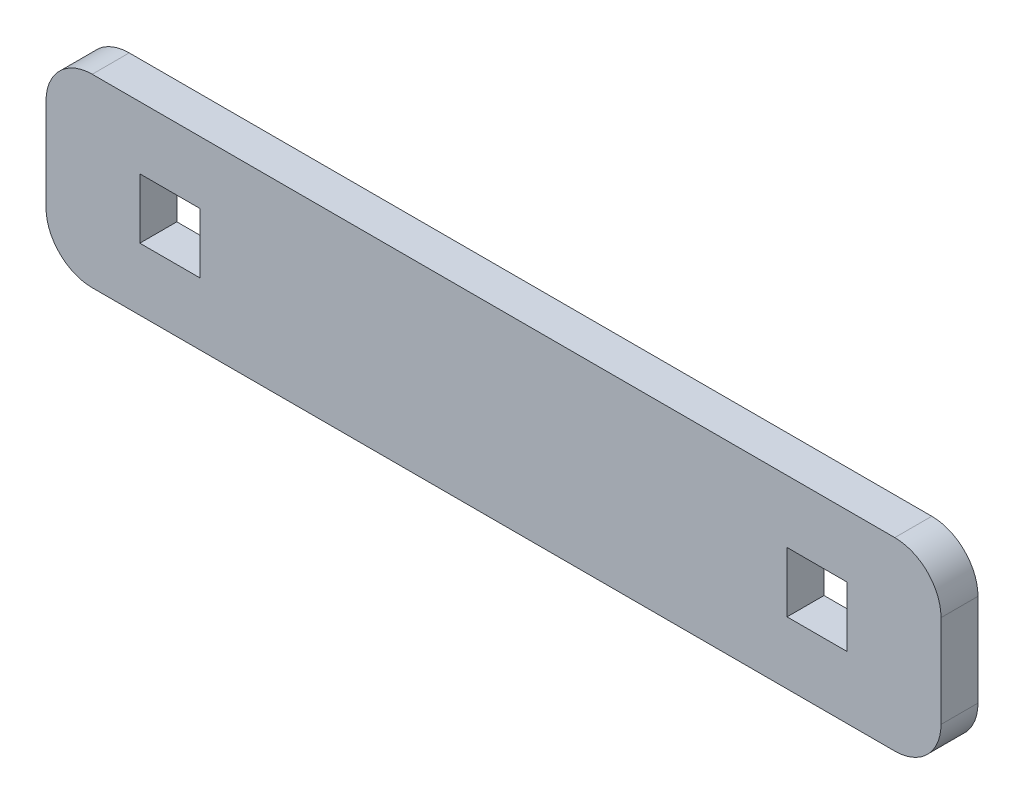
ISO-10303-21;
HEADER;
FILE_DESCRIPTION(('STEP AP214'),'2;1');
FILE_NAME('part.step','',(''),(''),'','','');
FILE_SCHEMA(('AUTOMOTIVE_DESIGN { 1 0 10303 214 1 1 1 1 }'));
ENDSEC;
DATA;
#1=APPLICATION_CONTEXT('core data for automotive mechanical design processes');
#2=APPLICATION_PROTOCOL_DEFINITION('international standard','automotive_design',2000,#1);
#3=PRODUCT_CONTEXT('',#1,'mechanical');
#4=PRODUCT('Part','Part','',(#3));
#5=PRODUCT_RELATED_PRODUCT_CATEGORY('part','',(#4));
#6=PRODUCT_DEFINITION_FORMATION('','',#4);
#7=PRODUCT_DEFINITION_CONTEXT('part definition',#1,'design');
#8=PRODUCT_DEFINITION('design','',#6,#7);
#9=PRODUCT_DEFINITION_SHAPE('','',#8);
#10=(LENGTH_UNIT() NAMED_UNIT(*) SI_UNIT(.MILLI.,.METRE.));
#11=(NAMED_UNIT(*) PLANE_ANGLE_UNIT() SI_UNIT($,.RADIAN.));
#12=(NAMED_UNIT(*) SI_UNIT($,.STERADIAN.) SOLID_ANGLE_UNIT());
#13=UNCERTAINTY_MEASURE_WITH_UNIT(LENGTH_MEASURE(1.E-05),#10,'distance_accuracy_value','');
#14=(GEOMETRIC_REPRESENTATION_CONTEXT(3) GLOBAL_UNCERTAINTY_ASSIGNED_CONTEXT((#13)) GLOBAL_UNIT_ASSIGNED_CONTEXT((#10,
#11,#12)) REPRESENTATION_CONTEXT('',''));
#15=CARTESIAN_POINT('',(0.,0.,0.));
#16=DIRECTION('',(0.,0.,1.));
#17=DIRECTION('',(1.,0.,0.));
#18=AXIS2_PLACEMENT_3D('',#15,#16,#17);
#19=CARTESIAN_POINT('',(-48.4,-10.,-4.));
#20=DIRECTION('',(-1.,0.,0.));
#21=DIRECTION('',(0.,-1.,0.));
#22=AXIS2_PLACEMENT_3D('',#19,#20,#21);
#23=PLANE('',#22);
#24=DIRECTION('',(0.,-1.,0.));
#25=VECTOR('',#24,1.);
#26=CARTESIAN_POINT('',(-48.4,-10.,-4.));
#27=LINE('',#26,#25);
#28=CARTESIAN_POINT('',(-48.4,5.,-4.));
#29=VERTEX_POINT('',#28);
#30=CARTESIAN_POINT('',(-48.4,-5.,-4.));
#31=VERTEX_POINT('',#30);
#32=EDGE_CURVE('E255',#29,#31,#27,.T.);
#33=ORIENTED_EDGE('',*,*,#32,.T.);
#34=DIRECTION('',(0.,0.,1.));
#35=VECTOR('',#34,1.);
#36=CARTESIAN_POINT('',(-48.4,-5.,-4.));
#37=LINE('',#36,#35);
#38=CARTESIAN_POINT('',(-48.4,-5.,0.));
#39=VERTEX_POINT('',#38);
#40=EDGE_CURVE('E288',#31,#39,#37,.T.);
#41=ORIENTED_EDGE('',*,*,#40,.T.);
#42=DIRECTION('',(0.,-1.,0.));
#43=VECTOR('',#42,1.);
#44=CARTESIAN_POINT('',(-48.4,-10.,0.));
#45=LINE('',#44,#43);
#46=CARTESIAN_POINT('',(-48.4,5.,0.));
#47=VERTEX_POINT('',#46);
#48=EDGE_CURVE('E245',#47,#39,#45,.T.);
#49=ORIENTED_EDGE('',*,*,#48,.F.);
#50=DIRECTION('',(0.,0.,1.));
#51=VECTOR('',#50,1.);
#52=CARTESIAN_POINT('',(-48.4,5.,-4.));
#53=LINE('',#52,#51);
#54=EDGE_CURVE('E271',#47,#29,#53,.F.);
#55=ORIENTED_EDGE('',*,*,#54,.T.);
#56=EDGE_LOOP('',(#33,#41,#49,#55));
#57=FACE_BOUND('',#56,.T.);
#58=ADVANCED_FACE('F40',(#57),#23,.T.);
#59=CARTESIAN_POINT('',(48.4,10.,-4.));
#60=DIRECTION('',(0.,1.,0.));
#61=DIRECTION('',(0.,0.,1.));
#62=AXIS2_PLACEMENT_3D('',#59,#60,#61);
#63=PLANE('',#62);
#64=DIRECTION('',(-1.,0.,0.));
#65=VECTOR('',#64,1.);
#66=CARTESIAN_POINT('',(48.4,10.,-4.));
#67=LINE('',#66,#65);
#68=CARTESIAN_POINT('',(43.4,10.,-4.));
#69=VERTEX_POINT('',#68);
#70=CARTESIAN_POINT('',(-43.4,10.,-4.));
#71=VERTEX_POINT('',#70);
#72=EDGE_CURVE('E267',#69,#71,#67,.T.);
#73=ORIENTED_EDGE('',*,*,#72,.T.);
#74=DIRECTION('',(0.,0.,1.));
#75=VECTOR('',#74,1.);
#76=CARTESIAN_POINT('',(-43.4,10.,-4.));
#77=LINE('',#76,#75);
#78=CARTESIAN_POINT('',(-43.4,10.,0.));
#79=VERTEX_POINT('',#78);
#80=EDGE_CURVE('E325',#71,#79,#77,.T.);
#81=ORIENTED_EDGE('',*,*,#80,.T.);
#82=DIRECTION('',(-1.,0.,0.));
#83=VECTOR('',#82,1.);
#84=CARTESIAN_POINT('',(48.4,10.,0.));
#85=LINE('',#84,#83);
#86=CARTESIAN_POINT('',(43.4,10.,0.));
#87=VERTEX_POINT('',#86);
#88=EDGE_CURVE('E260',#87,#79,#85,.T.);
#89=ORIENTED_EDGE('',*,*,#88,.F.);
#90=DIRECTION('',(0.,0.,1.));
#91=VECTOR('',#90,1.);
#92=CARTESIAN_POINT('',(43.4,10.,-4.));
#93=LINE('',#92,#91);
#94=EDGE_CURVE('E322',#87,#69,#93,.F.);
#95=ORIENTED_EDGE('',*,*,#94,.T.);
#96=EDGE_LOOP('',(#73,#81,#89,#95));
#97=FACE_BOUND('',#96,.T.);
#98=ADVANCED_FACE('F359',(#97),#63,.T.);
#99=CARTESIAN_POINT('',(48.4,-10.,-4.));
#100=DIRECTION('',(1.,0.,0.));
#101=DIRECTION('',(0.,1.,0.));
#102=AXIS2_PLACEMENT_3D('',#99,#100,#101);
#103=PLANE('',#102);
#104=DIRECTION('',(0.,1.,0.));
#105=VECTOR('',#104,1.);
#106=CARTESIAN_POINT('',(48.4,-10.,0.));
#107=LINE('',#106,#105);
#108=CARTESIAN_POINT('',(48.4,-5.,0.));
#109=VERTEX_POINT('',#108);
#110=CARTESIAN_POINT('',(48.4,5.,0.));
#111=VERTEX_POINT('',#110);
#112=EDGE_CURVE('E279',#109,#111,#107,.T.);
#113=ORIENTED_EDGE('',*,*,#112,.F.);
#114=DIRECTION('',(0.,0.,1.));
#115=VECTOR('',#114,1.);
#116=CARTESIAN_POINT('',(48.4,-5.,-4.));
#117=LINE('',#116,#115);
#118=CARTESIAN_POINT('',(48.4,-5.,-4.));
#119=VERTEX_POINT('',#118);
#120=EDGE_CURVE('E11',#109,#119,#117,.F.);
#121=ORIENTED_EDGE('',*,*,#120,.T.);
#122=DIRECTION('',(0.,1.,0.));
#123=VECTOR('',#122,1.);
#124=CARTESIAN_POINT('',(48.4,-10.,-4.));
#125=LINE('',#124,#123);
#126=CARTESIAN_POINT('',(48.4,5.,-4.));
#127=VERTEX_POINT('',#126);
#128=EDGE_CURVE('E264',#119,#127,#125,.T.);
#129=ORIENTED_EDGE('',*,*,#128,.T.);
#130=DIRECTION('',(0.,0.,1.));
#131=VECTOR('',#130,1.);
#132=CARTESIAN_POINT('',(48.4,5.,-4.));
#133=LINE('',#132,#131);
#134=EDGE_CURVE('E49',#127,#111,#133,.T.);
#135=ORIENTED_EDGE('',*,*,#134,.T.);
#136=EDGE_LOOP('',(#113,#121,#129,#135));
#137=FACE_BOUND('',#136,.T.);
#138=ADVANCED_FACE('F332',(#137),#103,.T.);
#139=CARTESIAN_POINT('',(48.4,-10.,-4.));
#140=DIRECTION('',(0.,-1.,0.));
#141=DIRECTION('',(0.,0.,-1.));
#142=AXIS2_PLACEMENT_3D('',#139,#140,#141);
#143=PLANE('',#142);
#144=DIRECTION('',(1.,0.,0.));
#145=VECTOR('',#144,1.);
#146=CARTESIAN_POINT('',(48.4,-10.,0.));
#147=LINE('',#146,#145);
#148=CARTESIAN_POINT('',(-43.4,-10.,0.));
#149=VERTEX_POINT('',#148);
#150=CARTESIAN_POINT('',(43.4,-10.,0.));
#151=VERTEX_POINT('',#150);
#152=EDGE_CURVE('E275',#149,#151,#147,.T.);
#153=ORIENTED_EDGE('',*,*,#152,.F.);
#154=DIRECTION('',(0.,0.,1.));
#155=VECTOR('',#154,1.);
#156=CARTESIAN_POINT('',(-43.4,-10.,-4.));
#157=LINE('',#156,#155);
#158=CARTESIAN_POINT('',(-43.4,-10.,-4.));
#159=VERTEX_POINT('',#158);
#160=EDGE_CURVE('E308',#149,#159,#157,.F.);
#161=ORIENTED_EDGE('',*,*,#160,.T.);
#162=DIRECTION('',(1.,0.,0.));
#163=VECTOR('',#162,1.);
#164=CARTESIAN_POINT('',(48.4,-10.,-4.));
#165=LINE('',#164,#163);
#166=CARTESIAN_POINT('',(43.4,-10.,-4.));
#167=VERTEX_POINT('',#166);
#168=EDGE_CURVE('E259',#159,#167,#165,.T.);
#169=ORIENTED_EDGE('',*,*,#168,.T.);
#170=DIRECTION('',(0.,0.,1.));
#171=VECTOR('',#170,1.);
#172=CARTESIAN_POINT('',(43.4,-10.,-4.));
#173=LINE('',#172,#171);
#174=EDGE_CURVE('E304',#167,#151,#173,.T.);
#175=ORIENTED_EDGE('',*,*,#174,.T.);
#176=EDGE_LOOP('',(#153,#161,#169,#175));
#177=FACE_BOUND('',#176,.T.);
#178=ADVANCED_FACE('F343',(#177),#143,.T.);
#179=CARTESIAN_POINT('',(0.,0.,-4.));
#180=DIRECTION('',(0.,0.,1.));
#181=DIRECTION('',(1.,0.,0.));
#182=AXIS2_PLACEMENT_3D('',#179,#180,#181);
#183=PLANE('',#182);
#184=DIRECTION('',(1.,0.,0.));
#185=VECTOR('',#184,1.);
#186=CARTESIAN_POINT('',(38.25,-3.25,-4.));
#187=LINE('',#186,#185);
#188=CARTESIAN_POINT('',(31.75,-3.25,-4.));
#189=VERTEX_POINT('',#188);
#190=CARTESIAN_POINT('',(38.25,-3.25,-4.));
#191=VERTEX_POINT('',#190);
#192=EDGE_CURVE('E167',#189,#191,#187,.T.);
#193=ORIENTED_EDGE('',*,*,#192,.T.);
#194=DIRECTION('',(0.,1.,0.));
#195=VECTOR('',#194,1.);
#196=CARTESIAN_POINT('',(38.25,-3.25,-4.));
#197=LINE('',#196,#195);
#198=CARTESIAN_POINT('',(38.25,3.25,-4.));
#199=VERTEX_POINT('',#198);
#200=EDGE_CURVE('E158',#191,#199,#197,.T.);
#201=ORIENTED_EDGE('',*,*,#200,.T.);
#202=DIRECTION('',(-1.,0.,0.));
#203=VECTOR('',#202,1.);
#204=CARTESIAN_POINT('',(38.25,3.25,-4.));
#205=LINE('',#204,#203);
#206=CARTESIAN_POINT('',(31.75,3.25,-4.));
#207=VERTEX_POINT('',#206);
#208=EDGE_CURVE('E171',#199,#207,#205,.T.);
#209=ORIENTED_EDGE('',*,*,#208,.T.);
#210=DIRECTION('',(0.,-1.,0.));
#211=VECTOR('',#210,1.);
#212=CARTESIAN_POINT('',(31.75,-3.25,-4.));
#213=LINE('',#212,#211);
#214=EDGE_CURVE('E176',#207,#189,#213,.T.);
#215=ORIENTED_EDGE('',*,*,#214,.T.);
#216=EDGE_LOOP('',(#193,#201,#209,#215));
#217=FACE_BOUND('',#216,.T.);
#218=DIRECTION('',(1.,0.,0.));
#219=VECTOR('',#218,1.);
#220=CARTESIAN_POINT('',(-38.25,-3.25,-4.));
#221=LINE('',#220,#219);
#222=CARTESIAN_POINT('',(-38.25,-3.25,-4.));
#223=VERTEX_POINT('',#222);
#224=CARTESIAN_POINT('',(-31.75,-3.25,-4.));
#225=VERTEX_POINT('',#224);
#226=EDGE_CURVE('E224',#223,#225,#221,.T.);
#227=ORIENTED_EDGE('',*,*,#226,.T.);
#228=DIRECTION('',(0.,1.,0.));
#229=VECTOR('',#228,1.);
#230=CARTESIAN_POINT('',(-31.75,-3.25,-4.));
#231=LINE('',#230,#229);
#232=CARTESIAN_POINT('',(-31.75,3.25,-4.));
#233=VERTEX_POINT('',#232);
#234=EDGE_CURVE('E211',#225,#233,#231,.T.);
#235=ORIENTED_EDGE('',*,*,#234,.T.);
#236=DIRECTION('',(-1.,0.,0.));
#237=VECTOR('',#236,1.);
#238=CARTESIAN_POINT('',(-38.25,3.25,-4.));
#239=LINE('',#238,#237);
#240=CARTESIAN_POINT('',(-38.25,3.25,-4.));
#241=VERTEX_POINT('',#240);
#242=EDGE_CURVE('E215',#233,#241,#239,.T.);
#243=ORIENTED_EDGE('',*,*,#242,.T.);
#244=DIRECTION('',(0.,-1.,0.));
#245=VECTOR('',#244,1.);
#246=CARTESIAN_POINT('',(-38.25,-3.25,-4.));
#247=LINE('',#246,#245);
#248=EDGE_CURVE('E220',#241,#223,#247,.T.);
#249=ORIENTED_EDGE('',*,*,#248,.T.);
#250=EDGE_LOOP('',(#227,#235,#243,#249));
#251=FACE_BOUND('',#250,.T.);
#252=ORIENTED_EDGE('',*,*,#168,.F.);
#253=CARTESIAN_POINT('',(-43.4,-5.,-4.));
#254=DIRECTION('',(0.,0.,1.));
#255=DIRECTION('',(1.,0.,0.));
#256=AXIS2_PLACEMENT_3D('',#253,#254,#255);
#257=CIRCLE('',#256,5.);
#258=EDGE_CURVE('E319',#159,#31,#257,.F.);
#259=ORIENTED_EDGE('',*,*,#258,.T.);
#260=ORIENTED_EDGE('',*,*,#32,.F.);
#261=CARTESIAN_POINT('',(-43.4,5.,-4.));
#262=DIRECTION('',(0.,0.,1.));
#263=DIRECTION('',(1.,0.,0.));
#264=AXIS2_PLACEMENT_3D('',#261,#262,#263);
#265=CIRCLE('',#264,5.);
#266=EDGE_CURVE('E316',#29,#71,#265,.F.);
#267=ORIENTED_EDGE('',*,*,#266,.T.);
#268=ORIENTED_EDGE('',*,*,#72,.F.);
#269=CARTESIAN_POINT('',(43.4,5.,-4.));
#270=DIRECTION('',(0.,0.,1.));
#271=DIRECTION('',(1.,0.,0.));
#272=AXIS2_PLACEMENT_3D('',#269,#270,#271);
#273=CIRCLE('',#272,5.);
#274=EDGE_CURVE('E56',#69,#127,#273,.F.);
#275=ORIENTED_EDGE('',*,*,#274,.T.);
#276=ORIENTED_EDGE('',*,*,#128,.F.);
#277=CARTESIAN_POINT('',(43.4,-5.,-4.));
#278=DIRECTION('',(0.,0.,1.));
#279=DIRECTION('',(1.,0.,0.));
#280=AXIS2_PLACEMENT_3D('',#277,#278,#279);
#281=CIRCLE('',#280,5.);
#282=EDGE_CURVE('E313',#119,#167,#281,.F.);
#283=ORIENTED_EDGE('',*,*,#282,.T.);
#284=EDGE_LOOP('',(#252,#259,#260,#267,#268,#275,#276,#283));
#285=FACE_BOUND('',#284,.T.);
#286=ADVANCED_FACE('F178',(#217,#251,#285),#183,.F.);
#287=CARTESIAN_POINT('',(0.,0.,0.));
#288=DIRECTION('',(0.,0.,1.));
#289=DIRECTION('',(1.,0.,0.));
#290=AXIS2_PLACEMENT_3D('',#287,#288,#289);
#291=PLANE('',#290);
#292=DIRECTION('',(0.,1.,0.));
#293=VECTOR('',#292,1.);
#294=CARTESIAN_POINT('',(38.25,-3.25,0.));
#295=LINE('',#294,#293);
#296=CARTESIAN_POINT('',(38.25,-3.25,0.));
#297=VERTEX_POINT('',#296);
#298=CARTESIAN_POINT('',(38.25,3.25,0.));
#299=VERTEX_POINT('',#298);
#300=EDGE_CURVE('E161',#297,#299,#295,.T.);
#301=ORIENTED_EDGE('',*,*,#300,.F.);
#302=DIRECTION('',(1.,0.,0.));
#303=VECTOR('',#302,1.);
#304=CARTESIAN_POINT('',(38.25,-3.25,0.));
#305=LINE('',#304,#303);
#306=CARTESIAN_POINT('',(31.75,-3.25,0.));
#307=VERTEX_POINT('',#306);
#308=EDGE_CURVE('E182',#307,#297,#305,.T.);
#309=ORIENTED_EDGE('',*,*,#308,.F.);
#310=DIRECTION('',(0.,-1.,0.));
#311=VECTOR('',#310,1.);
#312=CARTESIAN_POINT('',(31.75,-3.25,0.));
#313=LINE('',#312,#311);
#314=CARTESIAN_POINT('',(31.75,3.25,0.));
#315=VERTEX_POINT('',#314);
#316=EDGE_CURVE('E187',#315,#307,#313,.T.);
#317=ORIENTED_EDGE('',*,*,#316,.F.);
#318=DIRECTION('',(-1.,0.,0.));
#319=VECTOR('',#318,1.);
#320=CARTESIAN_POINT('',(38.25,3.25,0.));
#321=LINE('',#320,#319);
#322=EDGE_CURVE('E196',#299,#315,#321,.T.);
#323=ORIENTED_EDGE('',*,*,#322,.F.);
#324=EDGE_LOOP('',(#301,#309,#317,#323));
#325=FACE_BOUND('',#324,.T.);
#326=DIRECTION('',(0.,1.,0.));
#327=VECTOR('',#326,1.);
#328=CARTESIAN_POINT('',(-31.75,-3.25,0.));
#329=LINE('',#328,#327);
#330=CARTESIAN_POINT('',(-31.75,-3.25,0.));
#331=VERTEX_POINT('',#330);
#332=CARTESIAN_POINT('',(-31.75,3.25,0.));
#333=VERTEX_POINT('',#332);
#334=EDGE_CURVE('E205',#331,#333,#329,.T.);
#335=ORIENTED_EDGE('',*,*,#334,.F.);
#336=DIRECTION('',(1.,0.,0.));
#337=VECTOR('',#336,1.);
#338=CARTESIAN_POINT('',(-38.25,-3.25,0.));
#339=LINE('',#338,#337);
#340=CARTESIAN_POINT('',(-38.25,-3.25,0.));
#341=VERTEX_POINT('',#340);
#342=EDGE_CURVE('E216',#341,#331,#339,.T.);
#343=ORIENTED_EDGE('',*,*,#342,.F.);
#344=DIRECTION('',(0.,-1.,0.));
#345=VECTOR('',#344,1.);
#346=CARTESIAN_POINT('',(-38.25,-3.25,0.));
#347=LINE('',#346,#345);
#348=CARTESIAN_POINT('',(-38.25,3.25,0.));
#349=VERTEX_POINT('',#348);
#350=EDGE_CURVE('E235',#349,#341,#347,.T.);
#351=ORIENTED_EDGE('',*,*,#350,.F.);
#352=DIRECTION('',(-1.,0.,0.));
#353=VECTOR('',#352,1.);
#354=CARTESIAN_POINT('',(-38.25,3.25,0.));
#355=LINE('',#354,#353);
#356=EDGE_CURVE('E231',#333,#349,#355,.T.);
#357=ORIENTED_EDGE('',*,*,#356,.F.);
#358=EDGE_LOOP('',(#335,#343,#351,#357));
#359=FACE_BOUND('',#358,.T.);
#360=ORIENTED_EDGE('',*,*,#48,.T.);
#361=CARTESIAN_POINT('',(-43.4,-5.,0.));
#362=DIRECTION('',(0.,0.,1.));
#363=DIRECTION('',(1.,0.,0.));
#364=AXIS2_PLACEMENT_3D('',#361,#362,#363);
#365=CIRCLE('',#364,5.);
#366=EDGE_CURVE('E301',#39,#149,#365,.T.);
#367=ORIENTED_EDGE('',*,*,#366,.T.);
#368=ORIENTED_EDGE('',*,*,#152,.T.);
#369=CARTESIAN_POINT('',(43.4,-5.,0.));
#370=DIRECTION('',(0.,0.,1.));
#371=DIRECTION('',(1.,0.,0.));
#372=AXIS2_PLACEMENT_3D('',#369,#370,#371);
#373=CIRCLE('',#372,5.);
#374=EDGE_CURVE('E295',#151,#109,#373,.T.);
#375=ORIENTED_EDGE('',*,*,#374,.T.);
#376=ORIENTED_EDGE('',*,*,#112,.T.);
#377=CARTESIAN_POINT('',(43.4,5.,0.));
#378=DIRECTION('',(0.,0.,1.));
#379=DIRECTION('',(1.,0.,0.));
#380=AXIS2_PLACEMENT_3D('',#377,#378,#379);
#381=CIRCLE('',#380,5.);
#382=EDGE_CURVE('E292',#111,#87,#381,.T.);
#383=ORIENTED_EDGE('',*,*,#382,.T.);
#384=ORIENTED_EDGE('',*,*,#88,.T.);
#385=CARTESIAN_POINT('',(-43.4,5.,0.));
#386=DIRECTION('',(0.,0.,1.));
#387=DIRECTION('',(1.,0.,0.));
#388=AXIS2_PLACEMENT_3D('',#385,#386,#387);
#389=CIRCLE('',#388,5.);
#390=EDGE_CURVE('E298',#79,#47,#389,.T.);
#391=ORIENTED_EDGE('',*,*,#390,.T.);
#392=EDGE_LOOP('',(#360,#367,#368,#375,#376,#383,#384,#391));
#393=FACE_BOUND('',#392,.T.);
#394=ADVANCED_FACE('F335',(#325,#359,#393),#291,.T.);
#395=CARTESIAN_POINT('',(-31.75,-3.25,-4.));
#396=DIRECTION('',(1.,0.,0.));
#397=DIRECTION('',(0.,0.,-1.));
#398=AXIS2_PLACEMENT_3D('',#395,#396,#397);
#399=PLANE('',#398);
#400=ORIENTED_EDGE('',*,*,#334,.T.);
#401=DIRECTION('',(0.,0.,1.));
#402=VECTOR('',#401,1.);
#403=CARTESIAN_POINT('',(-31.75,3.25,-4.));
#404=LINE('',#403,#402);
#405=EDGE_CURVE('E228',#233,#333,#404,.T.);
#406=ORIENTED_EDGE('',*,*,#405,.F.);
#407=ORIENTED_EDGE('',*,*,#234,.F.);
#408=DIRECTION('',(0.,0.,1.));
#409=VECTOR('',#408,1.);
#410=CARTESIAN_POINT('',(-31.75,-3.25,-4.));
#411=LINE('',#410,#409);
#412=EDGE_CURVE('E242',#225,#331,#411,.T.);
#413=ORIENTED_EDGE('',*,*,#412,.T.);
#414=EDGE_LOOP('',(#400,#406,#407,#413));
#415=FACE_BOUND('',#414,.T.);
#416=ADVANCED_FACE('F487',(#415),#399,.F.);
#417=CARTESIAN_POINT('',(-38.25,-3.25,-4.));
#418=DIRECTION('',(0.,-1.,0.));
#419=DIRECTION('',(0.,0.,-1.));
#420=AXIS2_PLACEMENT_3D('',#417,#418,#419);
#421=PLANE('',#420);
#422=ORIENTED_EDGE('',*,*,#342,.T.);
#423=ORIENTED_EDGE('',*,*,#412,.F.);
#424=ORIENTED_EDGE('',*,*,#226,.F.);
#425=DIRECTION('',(0.,0.,1.));
#426=VECTOR('',#425,1.);
#427=CARTESIAN_POINT('',(-38.25,-3.25,-4.));
#428=LINE('',#427,#426);
#429=EDGE_CURVE('E246',#223,#341,#428,.T.);
#430=ORIENTED_EDGE('',*,*,#429,.T.);
#431=EDGE_LOOP('',(#422,#423,#424,#430));
#432=FACE_BOUND('',#431,.T.);
#433=ADVANCED_FACE('F476',(#432),#421,.F.);
#434=CARTESIAN_POINT('',(-38.25,-3.25,-4.));
#435=DIRECTION('',(-1.,0.,0.));
#436=DIRECTION('',(0.,0.,1.));
#437=AXIS2_PLACEMENT_3D('',#434,#435,#436);
#438=PLANE('',#437);
#439=ORIENTED_EDGE('',*,*,#350,.T.);
#440=ORIENTED_EDGE('',*,*,#429,.F.);
#441=ORIENTED_EDGE('',*,*,#248,.F.);
#442=DIRECTION('',(0.,0.,1.));
#443=VECTOR('',#442,1.);
#444=CARTESIAN_POINT('',(-38.25,3.25,-4.));
#445=LINE('',#444,#443);
#446=EDGE_CURVE('E249',#241,#349,#445,.T.);
#447=ORIENTED_EDGE('',*,*,#446,.T.);
#448=EDGE_LOOP('',(#439,#440,#441,#447));
#449=FACE_BOUND('',#448,.T.);
#450=ADVANCED_FACE('F465',(#449),#438,.F.);
#451=CARTESIAN_POINT('',(-38.25,3.25,-4.));
#452=DIRECTION('',(0.,1.,0.));
#453=DIRECTION('',(0.,0.,1.));
#454=AXIS2_PLACEMENT_3D('',#451,#452,#453);
#455=PLANE('',#454);
#456=ORIENTED_EDGE('',*,*,#356,.T.);
#457=ORIENTED_EDGE('',*,*,#446,.F.);
#458=ORIENTED_EDGE('',*,*,#242,.F.);
#459=ORIENTED_EDGE('',*,*,#405,.T.);
#460=EDGE_LOOP('',(#456,#457,#458,#459));
#461=FACE_BOUND('',#460,.T.);
#462=ADVANCED_FACE('F455',(#461),#455,.F.);
#463=CARTESIAN_POINT('',(38.25,-3.25,-4.));
#464=DIRECTION('',(1.,0.,0.));
#465=DIRECTION('',(0.,0.,-1.));
#466=AXIS2_PLACEMENT_3D('',#463,#464,#465);
#467=PLANE('',#466);
#468=ORIENTED_EDGE('',*,*,#300,.T.);
#469=DIRECTION('',(0.,0.,1.));
#470=VECTOR('',#469,1.);
#471=CARTESIAN_POINT('',(38.25,3.25,-4.));
#472=LINE('',#471,#470);
#473=EDGE_CURVE('E154',#199,#299,#472,.T.);
#474=ORIENTED_EDGE('',*,*,#473,.F.);
#475=ORIENTED_EDGE('',*,*,#200,.F.);
#476=DIRECTION('',(0.,0.,1.));
#477=VECTOR('',#476,1.);
#478=CARTESIAN_POINT('',(38.25,-3.25,-4.));
#479=LINE('',#478,#477);
#480=EDGE_CURVE('E202',#191,#297,#479,.T.);
#481=ORIENTED_EDGE('',*,*,#480,.T.);
#482=EDGE_LOOP('',(#468,#474,#475,#481));
#483=FACE_BOUND('',#482,.T.);
#484=ADVANCED_FACE('F156',(#483),#467,.F.);
#485=CARTESIAN_POINT('',(38.25,-3.25,-4.));
#486=DIRECTION('',(0.,-1.,0.));
#487=DIRECTION('',(0.,0.,-1.));
#488=AXIS2_PLACEMENT_3D('',#485,#486,#487);
#489=PLANE('',#488);
#490=ORIENTED_EDGE('',*,*,#308,.T.);
#491=ORIENTED_EDGE('',*,*,#480,.F.);
#492=ORIENTED_EDGE('',*,*,#192,.F.);
#493=DIRECTION('',(0.,0.,1.));
#494=VECTOR('',#493,1.);
#495=CARTESIAN_POINT('',(31.75,-3.25,-4.));
#496=LINE('',#495,#494);
#497=EDGE_CURVE('E206',#189,#307,#496,.T.);
#498=ORIENTED_EDGE('',*,*,#497,.T.);
#499=EDGE_LOOP('',(#490,#491,#492,#498));
#500=FACE_BOUND('',#499,.T.);
#501=ADVANCED_FACE('F434',(#500),#489,.F.);
#502=CARTESIAN_POINT('',(31.75,-3.25,-4.));
#503=DIRECTION('',(-1.,0.,0.));
#504=DIRECTION('',(0.,0.,1.));
#505=AXIS2_PLACEMENT_3D('',#502,#503,#504);
#506=PLANE('',#505);
#507=ORIENTED_EDGE('',*,*,#316,.T.);
#508=ORIENTED_EDGE('',*,*,#497,.F.);
#509=ORIENTED_EDGE('',*,*,#214,.F.);
#510=DIRECTION('',(0.,0.,1.));
#511=VECTOR('',#510,1.);
#512=CARTESIAN_POINT('',(31.75,3.25,-4.));
#513=LINE('',#512,#511);
#514=EDGE_CURVE('E166',#207,#315,#513,.T.);
#515=ORIENTED_EDGE('',*,*,#514,.T.);
#516=EDGE_LOOP('',(#507,#508,#509,#515));
#517=FACE_BOUND('',#516,.T.);
#518=ADVANCED_FACE('F424',(#517),#506,.F.);
#519=CARTESIAN_POINT('',(38.25,3.25,-4.));
#520=DIRECTION('',(0.,1.,0.));
#521=DIRECTION('',(0.,0.,1.));
#522=AXIS2_PLACEMENT_3D('',#519,#520,#521);
#523=PLANE('',#522);
#524=ORIENTED_EDGE('',*,*,#322,.T.);
#525=ORIENTED_EDGE('',*,*,#514,.F.);
#526=ORIENTED_EDGE('',*,*,#208,.F.);
#527=ORIENTED_EDGE('',*,*,#473,.T.);
#528=EDGE_LOOP('',(#524,#525,#526,#527));
#529=FACE_BOUND('',#528,.T.);
#530=ADVANCED_FACE('F172',(#529),#523,.F.);
#531=CARTESIAN_POINT('',(-43.4,-5.,-4.));
#532=DIRECTION('',(0.,0.,1.));
#533=DIRECTION('',(1.,0.,0.));
#534=AXIS2_PLACEMENT_3D('',#531,#532,#533);
#535=CYLINDRICAL_SURFACE('',#534,5.);
#536=ORIENTED_EDGE('',*,*,#258,.F.);
#537=ORIENTED_EDGE('',*,*,#160,.F.);
#538=ORIENTED_EDGE('',*,*,#366,.F.);
#539=ORIENTED_EDGE('',*,*,#40,.F.);
#540=EDGE_LOOP('',(#536,#537,#538,#539));
#541=FACE_BOUND('',#540,.T.);
#542=ADVANCED_FACE('F350',(#541),#535,.T.);
#543=CARTESIAN_POINT('',(-43.4,5.,-4.));
#544=DIRECTION('',(0.,0.,1.));
#545=DIRECTION('',(1.,0.,0.));
#546=AXIS2_PLACEMENT_3D('',#543,#544,#545);
#547=CYLINDRICAL_SURFACE('',#546,5.);
#548=ORIENTED_EDGE('',*,*,#266,.F.);
#549=ORIENTED_EDGE('',*,*,#54,.F.);
#550=ORIENTED_EDGE('',*,*,#390,.F.);
#551=ORIENTED_EDGE('',*,*,#80,.F.);
#552=EDGE_LOOP('',(#548,#549,#550,#551));
#553=FACE_BOUND('',#552,.T.);
#554=ADVANCED_FACE('F357',(#553),#547,.T.);
#555=CARTESIAN_POINT('',(43.4,-5.,-4.));
#556=DIRECTION('',(0.,0.,1.));
#557=DIRECTION('',(1.,0.,0.));
#558=AXIS2_PLACEMENT_3D('',#555,#556,#557);
#559=CYLINDRICAL_SURFACE('',#558,5.);
#560=ORIENTED_EDGE('',*,*,#282,.F.);
#561=ORIENTED_EDGE('',*,*,#120,.F.);
#562=ORIENTED_EDGE('',*,*,#374,.F.);
#563=ORIENTED_EDGE('',*,*,#174,.F.);
#564=EDGE_LOOP('',(#560,#561,#562,#563));
#565=FACE_BOUND('',#564,.T.);
#566=ADVANCED_FACE('F341',(#565),#559,.T.);
#567=CARTESIAN_POINT('',(43.4,5.,-4.));
#568=DIRECTION('',(0.,0.,1.));
#569=DIRECTION('',(1.,0.,0.));
#570=AXIS2_PLACEMENT_3D('',#567,#568,#569);
#571=CYLINDRICAL_SURFACE('',#570,5.);
#572=ORIENTED_EDGE('',*,*,#274,.F.);
#573=ORIENTED_EDGE('',*,*,#94,.F.);
#574=ORIENTED_EDGE('',*,*,#382,.F.);
#575=ORIENTED_EDGE('',*,*,#134,.F.);
#576=EDGE_LOOP('',(#572,#573,#574,#575));
#577=FACE_BOUND('',#576,.T.);
#578=ADVANCED_FACE('F42',(#577),#571,.T.);
#579=CLOSED_SHELL('',(#58,#98,#138,#178,#286,#394,#416,#433,#450,#462,#484,#501,#518,#530,#542,
#554,#566,#578));
#580=MANIFOLD_SOLID_BREP('B2',#579);
#581=ADVANCED_BREP_SHAPE_REPRESENTATION('',(#18,#580),#14);
#582=SHAPE_DEFINITION_REPRESENTATION(#9,#581);
ENDSEC;
END-ISO-10303-21;
